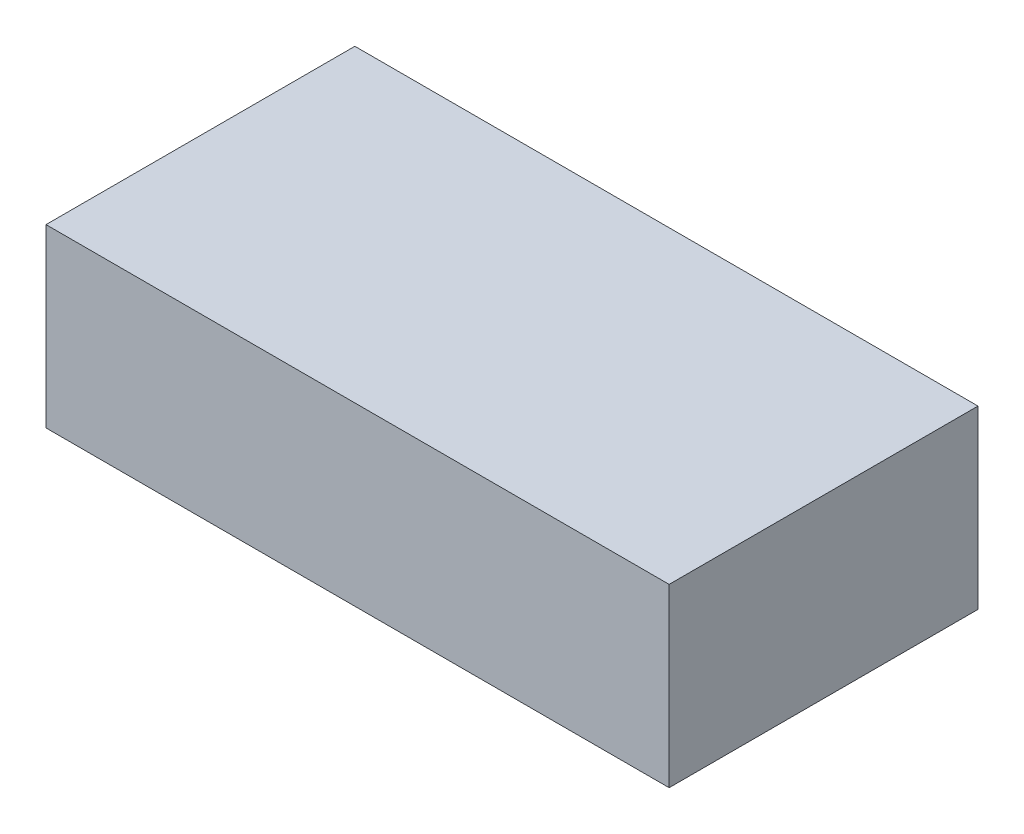
ISO-10303-21;
HEADER;
FILE_DESCRIPTION(('STEP AP214'),'2;1');
FILE_NAME('part.step','',(''),(''),'','','');
FILE_SCHEMA(('AUTOMOTIVE_DESIGN { 1 0 10303 214 1 1 1 1 }'));
ENDSEC;
DATA;
#1=APPLICATION_CONTEXT('core data for automotive mechanical design processes');
#2=APPLICATION_PROTOCOL_DEFINITION('international standard','automotive_design',2000,#1);
#3=PRODUCT_CONTEXT('',#1,'mechanical');
#4=PRODUCT('Part','Part','',(#3));
#5=PRODUCT_RELATED_PRODUCT_CATEGORY('part','',(#4));
#6=PRODUCT_DEFINITION_FORMATION('','',#4);
#7=PRODUCT_DEFINITION_CONTEXT('part definition',#1,'design');
#8=PRODUCT_DEFINITION('design','',#6,#7);
#9=PRODUCT_DEFINITION_SHAPE('','',#8);
#10=(LENGTH_UNIT() NAMED_UNIT(*) SI_UNIT(.MILLI.,.METRE.));
#11=(NAMED_UNIT(*) PLANE_ANGLE_UNIT() SI_UNIT($,.RADIAN.));
#12=(NAMED_UNIT(*) SI_UNIT($,.STERADIAN.) SOLID_ANGLE_UNIT());
#13=UNCERTAINTY_MEASURE_WITH_UNIT(LENGTH_MEASURE(1.E-05),#10,'distance_accuracy_value','');
#14=(GEOMETRIC_REPRESENTATION_CONTEXT(3) GLOBAL_UNCERTAINTY_ASSIGNED_CONTEXT((#13)) GLOBAL_UNIT_ASSIGNED_CONTEXT((#10,
#11,#12)) REPRESENTATION_CONTEXT('',''));
#15=CARTESIAN_POINT('',(0.,0.,0.));
#16=DIRECTION('',(0.,0.,1.));
#17=DIRECTION('',(1.,0.,0.));
#18=AXIS2_PLACEMENT_3D('',#15,#16,#17);
#19=CARTESIAN_POINT('',(0.,65.,0.));
#20=DIRECTION('',(1.,0.,0.));
#21=DIRECTION('',(0.,0.,-1.));
#22=AXIS2_PLACEMENT_3D('',#19,#20,#21);
#23=PLANE('',#22);
#24=DIRECTION('',(0.,0.,1.));
#25=VECTOR('',#24,1.);
#26=CARTESIAN_POINT('',(0.,0.,0.));
#27=LINE('',#26,#25);
#28=CARTESIAN_POINT('',(0.,0.,-114.));
#29=VERTEX_POINT('',#28);
#30=CARTESIAN_POINT('',(0.,0.,0.));
#31=VERTEX_POINT('',#30);
#32=EDGE_CURVE('E100',#29,#31,#27,.T.);
#33=ORIENTED_EDGE('',*,*,#32,.T.);
#34=DIRECTION('',(0.,-1.,0.));
#35=VECTOR('',#34,1.);
#36=CARTESIAN_POINT('',(0.,65.,0.));
#37=LINE('',#36,#35);
#38=CARTESIAN_POINT('',(0.,65.,0.));
#39=VERTEX_POINT('',#38);
#40=EDGE_CURVE('E11',#39,#31,#37,.T.);
#41=ORIENTED_EDGE('',*,*,#40,.F.);
#42=DIRECTION('',(0.,0.,1.));
#43=VECTOR('',#42,1.);
#44=CARTESIAN_POINT('',(0.,65.,0.));
#45=LINE('',#44,#43);
#46=CARTESIAN_POINT('',(0.,65.,-114.));
#47=VERTEX_POINT('',#46);
#48=EDGE_CURVE('E88',#47,#39,#45,.T.);
#49=ORIENTED_EDGE('',*,*,#48,.F.);
#50=DIRECTION('',(0.,-1.,0.));
#51=VECTOR('',#50,1.);
#52=CARTESIAN_POINT('',(0.,65.,-114.));
#53=LINE('',#52,#51);
#54=EDGE_CURVE('E96',#47,#29,#53,.T.);
#55=ORIENTED_EDGE('',*,*,#54,.T.);
#56=EDGE_LOOP('',(#33,#41,#49,#55));
#57=FACE_BOUND('',#56,.T.);
#58=ADVANCED_FACE('F37',(#57),#23,.F.);
#59=CARTESIAN_POINT('',(0.,65.,0.));
#60=DIRECTION('',(0.,0.,-1.));
#61=DIRECTION('',(-1.,0.,0.));
#62=AXIS2_PLACEMENT_3D('',#59,#60,#61);
#63=PLANE('',#62);
#64=DIRECTION('',(1.,0.,0.));
#65=VECTOR('',#64,1.);
#66=CARTESIAN_POINT('',(0.,0.,0.));
#67=LINE('',#66,#65);
#68=CARTESIAN_POINT('',(230.,0.,0.));
#69=VERTEX_POINT('',#68);
#70=EDGE_CURVE('E92',#31,#69,#67,.T.);
#71=ORIENTED_EDGE('',*,*,#70,.T.);
#72=DIRECTION('',(0.,-1.,0.));
#73=VECTOR('',#72,1.);
#74=CARTESIAN_POINT('',(230.,65.,0.));
#75=LINE('',#74,#73);
#76=CARTESIAN_POINT('',(230.,65.,0.));
#77=VERTEX_POINT('',#76);
#78=EDGE_CURVE('E45',#77,#69,#75,.T.);
#79=ORIENTED_EDGE('',*,*,#78,.F.);
#80=DIRECTION('',(1.,0.,0.));
#81=VECTOR('',#80,1.);
#82=CARTESIAN_POINT('',(0.,65.,0.));
#83=LINE('',#82,#81);
#84=EDGE_CURVE('E83',#39,#77,#83,.T.);
#85=ORIENTED_EDGE('',*,*,#84,.F.);
#86=ORIENTED_EDGE('',*,*,#40,.T.);
#87=EDGE_LOOP('',(#71,#79,#85,#86));
#88=FACE_BOUND('',#87,.T.);
#89=ADVANCED_FACE('F91',(#88),#63,.F.);
#90=CARTESIAN_POINT('',(230.,65.,0.));
#91=DIRECTION('',(-1.,0.,0.));
#92=DIRECTION('',(0.,0.,1.));
#93=AXIS2_PLACEMENT_3D('',#90,#91,#92);
#94=PLANE('',#93);
#95=DIRECTION('',(0.,0.,-1.));
#96=VECTOR('',#95,1.);
#97=CARTESIAN_POINT('',(230.,0.,0.));
#98=LINE('',#97,#96);
#99=CARTESIAN_POINT('',(230.,0.,-114.));
#100=VERTEX_POINT('',#99);
#101=EDGE_CURVE('E70',#69,#100,#98,.T.);
#102=ORIENTED_EDGE('',*,*,#101,.T.);
#103=DIRECTION('',(0.,-1.,0.));
#104=VECTOR('',#103,1.);
#105=CARTESIAN_POINT('',(230.,65.,-114.));
#106=LINE('',#105,#104);
#107=CARTESIAN_POINT('',(230.,65.,-114.));
#108=VERTEX_POINT('',#107);
#109=EDGE_CURVE('E93',#108,#100,#106,.T.);
#110=ORIENTED_EDGE('',*,*,#109,.F.);
#111=DIRECTION('',(0.,0.,-1.));
#112=VECTOR('',#111,1.);
#113=CARTESIAN_POINT('',(230.,65.,0.));
#114=LINE('',#113,#112);
#115=EDGE_CURVE('E86',#77,#108,#114,.T.);
#116=ORIENTED_EDGE('',*,*,#115,.F.);
#117=ORIENTED_EDGE('',*,*,#78,.T.);
#118=EDGE_LOOP('',(#102,#110,#116,#117));
#119=FACE_BOUND('',#118,.T.);
#120=ADVANCED_FACE('F94',(#119),#94,.F.);
#121=CARTESIAN_POINT('',(0.,65.,-114.));
#122=DIRECTION('',(0.,0.,1.));
#123=DIRECTION('',(1.,0.,0.));
#124=AXIS2_PLACEMENT_3D('',#121,#122,#123);
#125=PLANE('',#124);
#126=DIRECTION('',(-1.,0.,0.));
#127=VECTOR('',#126,1.);
#128=CARTESIAN_POINT('',(0.,0.,-114.));
#129=LINE('',#128,#127);
#130=EDGE_CURVE('E76',#100,#29,#129,.T.);
#131=ORIENTED_EDGE('',*,*,#130,.T.);
#132=ORIENTED_EDGE('',*,*,#54,.F.);
#133=DIRECTION('',(-1.,0.,0.));
#134=VECTOR('',#133,1.);
#135=CARTESIAN_POINT('',(0.,65.,-114.));
#136=LINE('',#135,#134);
#137=EDGE_CURVE('E53',#108,#47,#136,.T.);
#138=ORIENTED_EDGE('',*,*,#137,.F.);
#139=ORIENTED_EDGE('',*,*,#109,.T.);
#140=EDGE_LOOP('',(#131,#132,#138,#139));
#141=FACE_BOUND('',#140,.T.);
#142=ADVANCED_FACE('F107',(#141),#125,.F.);
#143=CARTESIAN_POINT('',(0.,65.,0.));
#144=DIRECTION('',(0.,-1.,0.));
#145=DIRECTION('',(0.,0.,-1.));
#146=AXIS2_PLACEMENT_3D('',#143,#144,#145);
#147=PLANE('',#146);
#148=ORIENTED_EDGE('',*,*,#48,.T.);
#149=ORIENTED_EDGE('',*,*,#84,.T.);
#150=ORIENTED_EDGE('',*,*,#115,.T.);
#151=ORIENTED_EDGE('',*,*,#137,.T.);
#152=EDGE_LOOP('',(#148,#149,#150,#151));
#153=FACE_BOUND('',#152,.T.);
#154=ADVANCED_FACE('F84',(#153),#147,.F.);
#155=CARTESIAN_POINT('',(0.,0.,0.));
#156=DIRECTION('',(0.,-1.,0.));
#157=DIRECTION('',(0.,0.,-1.));
#158=AXIS2_PLACEMENT_3D('',#155,#156,#157);
#159=PLANE('',#158);
#160=ORIENTED_EDGE('',*,*,#32,.F.);
#161=ORIENTED_EDGE('',*,*,#130,.F.);
#162=ORIENTED_EDGE('',*,*,#101,.F.);
#163=ORIENTED_EDGE('',*,*,#70,.F.);
#164=EDGE_LOOP('',(#160,#161,#162,#163));
#165=FACE_BOUND('',#164,.T.);
#166=ADVANCED_FACE('F110',(#165),#159,.T.);
#167=CLOSED_SHELL('',(#58,#89,#120,#142,#154,#166));
#168=MANIFOLD_SOLID_BREP('B2',#167);
#169=ADVANCED_BREP_SHAPE_REPRESENTATION('',(#18,#168),#14);
#170=SHAPE_DEFINITION_REPRESENTATION(#9,#169);
ENDSEC;
END-ISO-10303-21;
